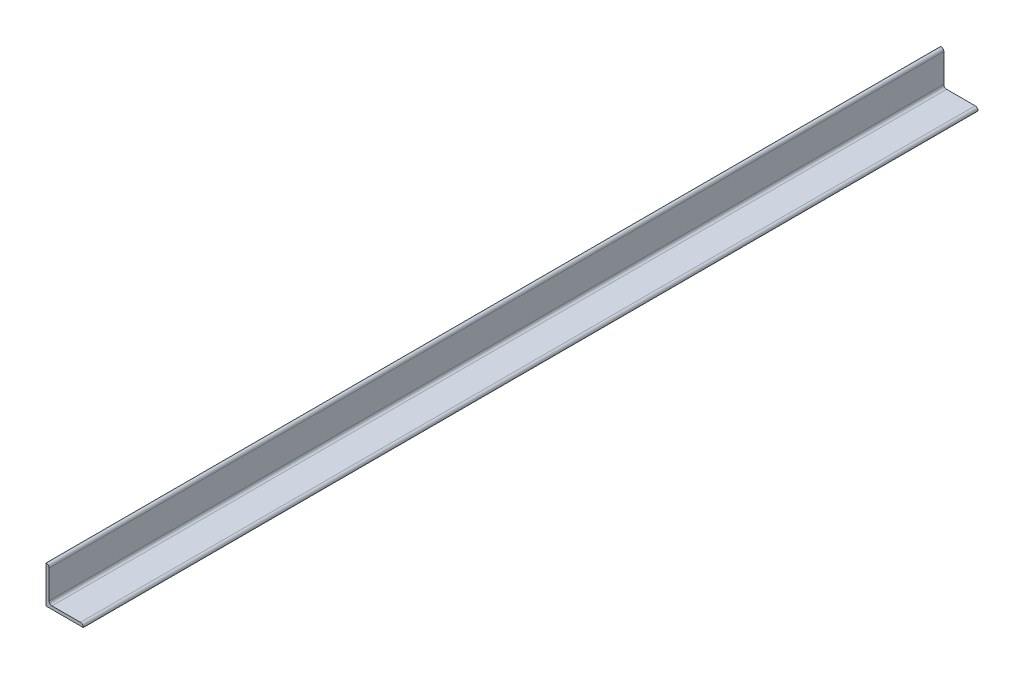
ISO-10303-21;
HEADER;
FILE_DESCRIPTION(('STEP AP214'),'2;1');
FILE_NAME('part.step','',(''),(''),'','','');
FILE_SCHEMA(('AUTOMOTIVE_DESIGN { 1 0 10303 214 1 1 1 1 }'));
ENDSEC;
DATA;
#1=APPLICATION_CONTEXT('core data for automotive mechanical design processes');
#2=APPLICATION_PROTOCOL_DEFINITION('international standard','automotive_design',2000,#1);
#3=PRODUCT_CONTEXT('',#1,'mechanical');
#4=PRODUCT('Part','Part','',(#3));
#5=PRODUCT_RELATED_PRODUCT_CATEGORY('part','',(#4));
#6=PRODUCT_DEFINITION_FORMATION('','',#4);
#7=PRODUCT_DEFINITION_CONTEXT('part definition',#1,'design');
#8=PRODUCT_DEFINITION('design','',#6,#7);
#9=PRODUCT_DEFINITION_SHAPE('','',#8);
#10=(LENGTH_UNIT() NAMED_UNIT(*) SI_UNIT(.MILLI.,.METRE.));
#11=(NAMED_UNIT(*) PLANE_ANGLE_UNIT() SI_UNIT($,.RADIAN.));
#12=(NAMED_UNIT(*) SI_UNIT($,.STERADIAN.) SOLID_ANGLE_UNIT());
#13=UNCERTAINTY_MEASURE_WITH_UNIT(LENGTH_MEASURE(1.E-05),#10,'distance_accuracy_value','');
#14=(GEOMETRIC_REPRESENTATION_CONTEXT(3) GLOBAL_UNCERTAINTY_ASSIGNED_CONTEXT((#13)) GLOBAL_UNIT_ASSIGNED_CONTEXT((#10,
#11,#12)) REPRESENTATION_CONTEXT('',''));
#15=CARTESIAN_POINT('',(0.,0.,0.));
#16=DIRECTION('',(0.,0.,1.));
#17=DIRECTION('',(1.,0.,0.));
#18=AXIS2_PLACEMENT_3D('',#15,#16,#17);
#19=CARTESIAN_POINT('',(6.35,76.2,0.));
#20=DIRECTION('',(0.,1.,0.));
#21=DIRECTION('',(0.,0.,1.));
#22=AXIS2_PLACEMENT_3D('',#19,#20,#21);
#23=PLANE('',#22);
#24=DIRECTION('',(1.,0.,0.));
#25=VECTOR('',#24,1.);
#26=CARTESIAN_POINT('',(0.,76.2,1828.8));
#27=LINE('',#26,#25);
#28=CARTESIAN_POINT('',(0.508,76.2,1828.8));
#29=VERTEX_POINT('',#28);
#30=CARTESIAN_POINT('',(0.,76.2,1828.8));
#31=VERTEX_POINT('',#30);
#32=EDGE_CURVE('E114',#29,#31,#27,.F.);
#33=ORIENTED_EDGE('',*,*,#32,.F.);
#34=DIRECTION('',(0.,0.,-1.));
#35=VECTOR('',#34,1.);
#36=CARTESIAN_POINT('',(0.508,76.2,4212.82368));
#37=LINE('',#36,#35);
#38=CARTESIAN_POINT('',(0.508,76.2,0.));
#39=VERTEX_POINT('',#38);
#40=EDGE_CURVE('E99',#39,#29,#37,.F.);
#41=ORIENTED_EDGE('',*,*,#40,.F.);
#42=DIRECTION('',(1.,0.,0.));
#43=VECTOR('',#42,1.);
#44=CARTESIAN_POINT('',(6.35,76.2,0.));
#45=LINE('',#44,#43);
#46=CARTESIAN_POINT('',(0.,76.2,0.));
#47=VERTEX_POINT('',#46);
#48=EDGE_CURVE('E141',#39,#47,#45,.F.);
#49=ORIENTED_EDGE('',*,*,#48,.T.);
#50=DIRECTION('',(0.,0.,1.));
#51=VECTOR('',#50,1.);
#52=CARTESIAN_POINT('',(0.,76.2,0.));
#53=LINE('',#52,#51);
#54=EDGE_CURVE('E146',#31,#47,#53,.F.);
#55=ORIENTED_EDGE('',*,*,#54,.F.);
#56=EDGE_LOOP('',(#33,#41,#49,#55));
#57=FACE_BOUND('',#56,.T.);
#58=ADVANCED_FACE('F16',(#57),#23,.T.);
#59=CARTESIAN_POINT('',(0.508,70.358,4212.82368));
#60=DIRECTION('',(0.,0.,-1.));
#61=DIRECTION('',(-1.,0.,0.));
#62=AXIS2_PLACEMENT_3D('',#59,#60,#61);
#63=CYLINDRICAL_SURFACE('',#62,5.842);
#64=DIRECTION('',(0.,0.,-1.));
#65=VECTOR('',#64,1.);
#66=CARTESIAN_POINT('',(6.35,70.358,0.));
#67=LINE('',#66,#65);
#68=CARTESIAN_POINT('',(6.35,70.358,0.));
#69=VERTEX_POINT('',#68);
#70=CARTESIAN_POINT('',(6.35,70.358,1828.8));
#71=VERTEX_POINT('',#70);
#72=EDGE_CURVE('E126',#69,#71,#67,.F.);
#73=ORIENTED_EDGE('',*,*,#72,.F.);
#74=CARTESIAN_POINT('',(0.508,70.358,0.));
#75=DIRECTION('',(0.,0.,-1.));
#76=DIRECTION('',(-1.,0.,0.));
#77=AXIS2_PLACEMENT_3D('',#74,#75,#76);
#78=CIRCLE('',#77,5.842);
#79=EDGE_CURVE('E148',#69,#39,#78,.F.);
#80=ORIENTED_EDGE('',*,*,#79,.T.);
#81=ORIENTED_EDGE('',*,*,#40,.T.);
#82=CARTESIAN_POINT('',(0.508,70.358,1828.8));
#83=DIRECTION('',(0.,0.,-1.));
#84=DIRECTION('',(-1.,0.,0.));
#85=AXIS2_PLACEMENT_3D('',#82,#83,#84);
#86=CIRCLE('',#85,5.842);
#87=EDGE_CURVE('E154',#71,#29,#86,.F.);
#88=ORIENTED_EDGE('',*,*,#87,.F.);
#89=EDGE_LOOP('',(#73,#80,#81,#88));
#90=FACE_BOUND('',#89,.T.);
#91=ADVANCED_FACE('F274',(#90),#63,.T.);
#92=CARTESIAN_POINT('',(70.358,0.508,4212.82368));
#93=DIRECTION('',(0.,0.,-1.));
#94=DIRECTION('',(-1.,0.,0.));
#95=AXIS2_PLACEMENT_3D('',#92,#93,#94);
#96=CYLINDRICAL_SURFACE('',#95,5.842);
#97=DIRECTION('',(0.,0.,-1.));
#98=VECTOR('',#97,1.);
#99=CARTESIAN_POINT('',(76.2,0.508,0.));
#100=LINE('',#99,#98);
#101=CARTESIAN_POINT('',(76.2,0.508,0.));
#102=VERTEX_POINT('',#101);
#103=CARTESIAN_POINT('',(76.2,0.508,1828.8));
#104=VERTEX_POINT('',#103);
#105=EDGE_CURVE('E84',#102,#104,#100,.F.);
#106=ORIENTED_EDGE('',*,*,#105,.F.);
#107=CARTESIAN_POINT('',(70.358,0.508,0.));
#108=DIRECTION('',(0.,0.,-1.));
#109=DIRECTION('',(-1.,0.,0.));
#110=AXIS2_PLACEMENT_3D('',#107,#108,#109);
#111=CIRCLE('',#110,5.842);
#112=CARTESIAN_POINT('',(70.358,6.35,0.));
#113=VERTEX_POINT('',#112);
#114=EDGE_CURVE('E95',#102,#113,#111,.F.);
#115=ORIENTED_EDGE('',*,*,#114,.T.);
#116=DIRECTION('',(0.,0.,1.));
#117=VECTOR('',#116,1.);
#118=CARTESIAN_POINT('',(70.358,6.35,0.));
#119=LINE('',#118,#117);
#120=CARTESIAN_POINT('',(70.358,6.35,1828.8));
#121=VERTEX_POINT('',#120);
#122=EDGE_CURVE('E89',#121,#113,#119,.F.);
#123=ORIENTED_EDGE('',*,*,#122,.F.);
#124=CARTESIAN_POINT('',(70.358,0.508,1828.8));
#125=DIRECTION('',(0.,0.,-1.));
#126=DIRECTION('',(-1.,0.,0.));
#127=AXIS2_PLACEMENT_3D('',#124,#125,#126);
#128=CIRCLE('',#127,5.842);
#129=EDGE_CURVE('E19',#104,#121,#128,.F.);
#130=ORIENTED_EDGE('',*,*,#129,.F.);
#131=EDGE_LOOP('',(#106,#115,#123,#130));
#132=FACE_BOUND('',#131,.T.);
#133=ADVANCED_FACE('F91',(#132),#96,.T.);
#134=CARTESIAN_POINT('',(76.2,6.35,0.));
#135=DIRECTION('',(0.,1.,0.));
#136=DIRECTION('',(0.,0.,1.));
#137=AXIS2_PLACEMENT_3D('',#134,#135,#136);
#138=PLANE('',#137);
#139=DIRECTION('',(1.,0.,0.));
#140=VECTOR('',#139,1.);
#141=CARTESIAN_POINT('',(0.,6.35,1828.8));
#142=LINE('',#141,#140);
#143=CARTESIAN_POINT('',(12.192,6.35,1828.8));
#144=VERTEX_POINT('',#143);
#145=EDGE_CURVE('E102',#121,#144,#142,.F.);
#146=ORIENTED_EDGE('',*,*,#145,.F.);
#147=ORIENTED_EDGE('',*,*,#122,.T.);
#148=DIRECTION('',(1.,0.,0.));
#149=VECTOR('',#148,1.);
#150=CARTESIAN_POINT('',(0.,6.35,0.));
#151=LINE('',#150,#149);
#152=CARTESIAN_POINT('',(12.192,6.35,0.));
#153=VERTEX_POINT('',#152);
#154=EDGE_CURVE('E166',#113,#153,#151,.F.);
#155=ORIENTED_EDGE('',*,*,#154,.T.);
#156=DIRECTION('',(0.,0.,1.));
#157=VECTOR('',#156,1.);
#158=CARTESIAN_POINT('',(12.192,6.35,-2384.02368));
#159=LINE('',#158,#157);
#160=EDGE_CURVE('E98',#153,#144,#159,.T.);
#161=ORIENTED_EDGE('',*,*,#160,.T.);
#162=EDGE_LOOP('',(#146,#147,#155,#161));
#163=FACE_BOUND('',#162,.T.);
#164=ADVANCED_FACE('F103',(#163),#138,.T.);
#165=CARTESIAN_POINT('',(12.192,12.192,-2384.02368));
#166=DIRECTION('',(0.,0.,1.));
#167=DIRECTION('',(1.,0.,0.));
#168=AXIS2_PLACEMENT_3D('',#165,#166,#167);
#169=CYLINDRICAL_SURFACE('',#168,5.842);
#170=ORIENTED_EDGE('',*,*,#160,.F.);
#171=CARTESIAN_POINT('',(12.192,12.192,0.));
#172=DIRECTION('',(0.,0.,1.));
#173=DIRECTION('',(1.,0.,0.));
#174=AXIS2_PLACEMENT_3D('',#171,#172,#173);
#175=CIRCLE('',#174,5.842);
#176=CARTESIAN_POINT('',(6.35,12.192,0.));
#177=VERTEX_POINT('',#176);
#178=EDGE_CURVE('E164',#153,#177,#175,.F.);
#179=ORIENTED_EDGE('',*,*,#178,.T.);
#180=DIRECTION('',(0.,0.,-1.));
#181=VECTOR('',#180,1.);
#182=CARTESIAN_POINT('',(6.35,12.192,0.));
#183=LINE('',#182,#181);
#184=CARTESIAN_POINT('',(6.35,12.192,1828.8));
#185=VERTEX_POINT('',#184);
#186=EDGE_CURVE('E123',#185,#177,#183,.T.);
#187=ORIENTED_EDGE('',*,*,#186,.F.);
#188=CARTESIAN_POINT('',(12.192,12.192,1828.8));
#189=DIRECTION('',(0.,0.,1.));
#190=DIRECTION('',(1.,0.,0.));
#191=AXIS2_PLACEMENT_3D('',#188,#189,#190);
#192=CIRCLE('',#191,5.842);
#193=EDGE_CURVE('E108',#144,#185,#192,.F.);
#194=ORIENTED_EDGE('',*,*,#193,.F.);
#195=EDGE_LOOP('',(#170,#179,#187,#194));
#196=FACE_BOUND('',#195,.T.);
#197=ADVANCED_FACE('F204',(#196),#169,.F.);
#198=CARTESIAN_POINT('',(6.35,6.35,0.));
#199=DIRECTION('',(1.,0.,0.));
#200=DIRECTION('',(0.,0.,-1.));
#201=AXIS2_PLACEMENT_3D('',#198,#199,#200);
#202=PLANE('',#201);
#203=DIRECTION('',(0.,1.,0.));
#204=VECTOR('',#203,1.);
#205=CARTESIAN_POINT('',(6.35,0.,0.));
#206=LINE('',#205,#204);
#207=EDGE_CURVE('E134',#177,#69,#206,.T.);
#208=ORIENTED_EDGE('',*,*,#207,.T.);
#209=ORIENTED_EDGE('',*,*,#72,.T.);
#210=DIRECTION('',(0.,1.,0.));
#211=VECTOR('',#210,1.);
#212=CARTESIAN_POINT('',(6.35,0.,1828.8));
#213=LINE('',#212,#211);
#214=EDGE_CURVE('E171',#185,#71,#213,.T.);
#215=ORIENTED_EDGE('',*,*,#214,.F.);
#216=ORIENTED_EDGE('',*,*,#186,.T.);
#217=EDGE_LOOP('',(#208,#209,#215,#216));
#218=FACE_BOUND('',#217,.T.);
#219=ADVANCED_FACE('F196',(#218),#202,.T.);
#220=CARTESIAN_POINT('',(76.2,0.,0.));
#221=DIRECTION('',(1.,0.,0.));
#222=DIRECTION('',(0.,0.,-1.));
#223=AXIS2_PLACEMENT_3D('',#220,#221,#222);
#224=PLANE('',#223);
#225=DIRECTION('',(0.,1.,0.));
#226=VECTOR('',#225,1.);
#227=CARTESIAN_POINT('',(76.2,0.,0.));
#228=LINE('',#227,#226);
#229=CARTESIAN_POINT('',(76.2,0.,0.));
#230=VERTEX_POINT('',#229);
#231=EDGE_CURVE('E161',#230,#102,#228,.T.);
#232=ORIENTED_EDGE('',*,*,#231,.T.);
#233=ORIENTED_EDGE('',*,*,#105,.T.);
#234=DIRECTION('',(0.,1.,0.));
#235=VECTOR('',#234,1.);
#236=CARTESIAN_POINT('',(76.2,0.,1828.8));
#237=LINE('',#236,#235);
#238=CARTESIAN_POINT('',(76.2,0.,1828.8));
#239=VERTEX_POINT('',#238);
#240=EDGE_CURVE('E113',#239,#104,#237,.T.);
#241=ORIENTED_EDGE('',*,*,#240,.F.);
#242=DIRECTION('',(0.,0.,-1.));
#243=VECTOR('',#242,1.);
#244=CARTESIAN_POINT('',(76.2,0.,0.));
#245=LINE('',#244,#243);
#246=EDGE_CURVE('E130',#230,#239,#245,.F.);
#247=ORIENTED_EDGE('',*,*,#246,.F.);
#248=EDGE_LOOP('',(#232,#233,#241,#247));
#249=FACE_BOUND('',#248,.T.);
#250=ADVANCED_FACE('F194',(#249),#224,.T.);
#251=CARTESIAN_POINT('',(0.,0.,1828.8));
#252=DIRECTION('',(0.,0.,1.));
#253=DIRECTION('',(1.,0.,0.));
#254=AXIS2_PLACEMENT_3D('',#251,#252,#253);
#255=PLANE('',#254);
#256=ORIENTED_EDGE('',*,*,#214,.T.);
#257=ORIENTED_EDGE('',*,*,#87,.T.);
#258=ORIENTED_EDGE('',*,*,#32,.T.);
#259=DIRECTION('',(0.,1.,0.));
#260=VECTOR('',#259,1.);
#261=CARTESIAN_POINT('',(0.,76.2,1828.8));
#262=LINE('',#261,#260);
#263=CARTESIAN_POINT('',(0.,0.,1828.8));
#264=VERTEX_POINT('',#263);
#265=EDGE_CURVE('E149',#264,#31,#262,.T.);
#266=ORIENTED_EDGE('',*,*,#265,.F.);
#267=DIRECTION('',(1.,0.,0.));
#268=VECTOR('',#267,1.);
#269=CARTESIAN_POINT('',(0.,0.,1828.8));
#270=LINE('',#269,#268);
#271=EDGE_CURVE('E133',#239,#264,#270,.F.);
#272=ORIENTED_EDGE('',*,*,#271,.F.);
#273=ORIENTED_EDGE('',*,*,#240,.T.);
#274=ORIENTED_EDGE('',*,*,#129,.T.);
#275=ORIENTED_EDGE('',*,*,#145,.T.);
#276=ORIENTED_EDGE('',*,*,#193,.T.);
#277=EDGE_LOOP('',(#256,#257,#258,#266,#272,#273,#274,#275,#276));
#278=FACE_BOUND('',#277,.T.);
#279=ADVANCED_FACE('F111',(#278),#255,.T.);
#280=CARTESIAN_POINT('',(0.,76.2,0.));
#281=DIRECTION('',(-1.,0.,0.));
#282=DIRECTION('',(0.,0.,1.));
#283=AXIS2_PLACEMENT_3D('',#280,#281,#282);
#284=PLANE('',#283);
#285=ORIENTED_EDGE('',*,*,#54,.T.);
#286=DIRECTION('',(0.,1.,0.));
#287=VECTOR('',#286,1.);
#288=CARTESIAN_POINT('',(0.,0.,0.));
#289=LINE('',#288,#287);
#290=CARTESIAN_POINT('',(0.,0.,0.));
#291=VERTEX_POINT('',#290);
#292=EDGE_CURVE('E34',#47,#291,#289,.F.);
#293=ORIENTED_EDGE('',*,*,#292,.T.);
#294=DIRECTION('',(0.,0.,-1.));
#295=VECTOR('',#294,1.);
#296=CARTESIAN_POINT('',(0.,0.,0.));
#297=LINE('',#296,#295);
#298=EDGE_CURVE('E25',#264,#291,#297,.T.);
#299=ORIENTED_EDGE('',*,*,#298,.F.);
#300=ORIENTED_EDGE('',*,*,#265,.T.);
#301=EDGE_LOOP('',(#285,#293,#299,#300));
#302=FACE_BOUND('',#301,.T.);
#303=ADVANCED_FACE('F183',(#302),#284,.T.);
#304=CARTESIAN_POINT('',(0.,0.,0.));
#305=DIRECTION('',(0.,0.,1.));
#306=DIRECTION('',(1.,0.,0.));
#307=AXIS2_PLACEMENT_3D('',#304,#305,#306);
#308=PLANE('',#307);
#309=ORIENTED_EDGE('',*,*,#178,.F.);
#310=ORIENTED_EDGE('',*,*,#154,.F.);
#311=ORIENTED_EDGE('',*,*,#114,.F.);
#312=ORIENTED_EDGE('',*,*,#231,.F.);
#313=DIRECTION('',(1.,0.,0.));
#314=VECTOR('',#313,1.);
#315=CARTESIAN_POINT('',(0.,0.,0.));
#316=LINE('',#315,#314);
#317=EDGE_CURVE('E11',#291,#230,#316,.T.);
#318=ORIENTED_EDGE('',*,*,#317,.F.);
#319=ORIENTED_EDGE('',*,*,#292,.F.);
#320=ORIENTED_EDGE('',*,*,#48,.F.);
#321=ORIENTED_EDGE('',*,*,#79,.F.);
#322=ORIENTED_EDGE('',*,*,#207,.F.);
#323=EDGE_LOOP('',(#309,#310,#311,#312,#318,#319,#320,#321,#322));
#324=FACE_BOUND('',#323,.T.);
#325=ADVANCED_FACE('F191',(#324),#308,.F.);
#326=CARTESIAN_POINT('',(0.,0.,0.));
#327=DIRECTION('',(0.,-1.,0.));
#328=DIRECTION('',(0.,0.,-1.));
#329=AXIS2_PLACEMENT_3D('',#326,#327,#328);
#330=PLANE('',#329);
#331=ORIENTED_EDGE('',*,*,#298,.T.);
#332=ORIENTED_EDGE('',*,*,#317,.T.);
#333=ORIENTED_EDGE('',*,*,#246,.T.);
#334=ORIENTED_EDGE('',*,*,#271,.T.);
#335=EDGE_LOOP('',(#331,#332,#333,#334));
#336=FACE_BOUND('',#335,.T.);
#337=ADVANCED_FACE('F182',(#336),#330,.T.);
#338=CLOSED_SHELL('',(#58,#91,#133,#164,#197,#219,#250,#279,#303,#325,#337));
#339=MANIFOLD_SOLID_BREP('B1',#338);
#340=ADVANCED_BREP_SHAPE_REPRESENTATION('',(#18,#339),#14);
#341=SHAPE_DEFINITION_REPRESENTATION(#9,#340);
ENDSEC;
END-ISO-10303-21;
